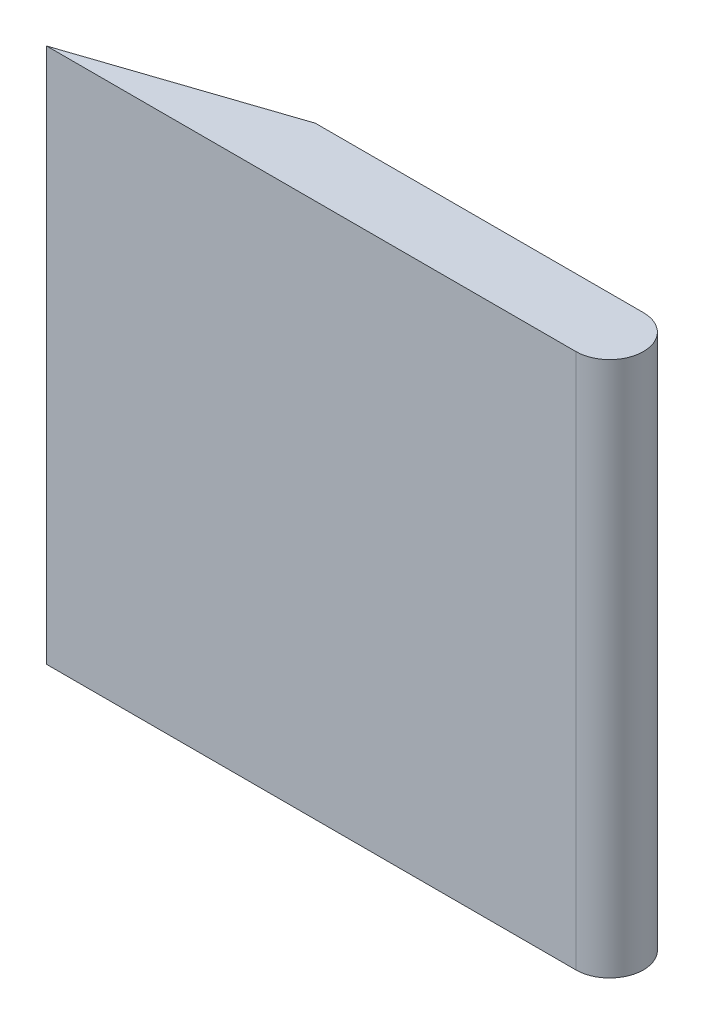
ISO-10303-21;
HEADER;
FILE_DESCRIPTION(('STEP AP214'),'2;1');
FILE_NAME('part.step','',(''),(''),'','','');
FILE_SCHEMA(('AUTOMOTIVE_DESIGN { 1 0 10303 214 1 1 1 1 }'));
ENDSEC;
DATA;
#1=APPLICATION_CONTEXT('core data for automotive mechanical design processes');
#2=APPLICATION_PROTOCOL_DEFINITION('international standard','automotive_design',2000,#1);
#3=PRODUCT_CONTEXT('',#1,'mechanical');
#4=PRODUCT('Part','Part','',(#3));
#5=PRODUCT_RELATED_PRODUCT_CATEGORY('part','',(#4));
#6=PRODUCT_DEFINITION_FORMATION('','',#4);
#7=PRODUCT_DEFINITION_CONTEXT('part definition',#1,'design');
#8=PRODUCT_DEFINITION('design','',#6,#7);
#9=PRODUCT_DEFINITION_SHAPE('','',#8);
#10=(LENGTH_UNIT() NAMED_UNIT(*) SI_UNIT(.MILLI.,.METRE.));
#11=(NAMED_UNIT(*) PLANE_ANGLE_UNIT() SI_UNIT($,.RADIAN.));
#12=(NAMED_UNIT(*) SI_UNIT($,.STERADIAN.) SOLID_ANGLE_UNIT());
#13=UNCERTAINTY_MEASURE_WITH_UNIT(LENGTH_MEASURE(1.E-05),#10,'distance_accuracy_value','');
#14=(GEOMETRIC_REPRESENTATION_CONTEXT(3) GLOBAL_UNCERTAINTY_ASSIGNED_CONTEXT((#13)) GLOBAL_UNIT_ASSIGNED_CONTEXT((#10,
#11,#12)) REPRESENTATION_CONTEXT('',''));
#15=CARTESIAN_POINT('',(0.,0.,0.));
#16=DIRECTION('',(0.,0.,1.));
#17=DIRECTION('',(1.,0.,0.));
#18=AXIS2_PLACEMENT_3D('',#15,#16,#17);
#19=CARTESIAN_POINT('',(0.,12.7,0.));
#20=DIRECTION('',(0.,-1.,0.));
#21=DIRECTION('',(0.,0.,-1.));
#22=AXIS2_PLACEMENT_3D('',#19,#20,#21);
#23=CYLINDRICAL_SURFACE('',#22,0.8);
#24=CARTESIAN_POINT('',(0.,0.,0.));
#25=DIRECTION('',(0.,1.,0.));
#26=DIRECTION('',(0.,0.,-1.));
#27=AXIS2_PLACEMENT_3D('',#24,#25,#26);
#28=CIRCLE('',#27,0.8);
#29=CARTESIAN_POINT('',(0.,0.,0.8));
#30=VERTEX_POINT('',#29);
#31=CARTESIAN_POINT('',(0.,0.,-0.8));
#32=VERTEX_POINT('',#31);
#33=EDGE_CURVE('E96',#30,#32,#28,.T.);
#34=ORIENTED_EDGE('',*,*,#33,.T.);
#35=DIRECTION('',(0.,-1.,0.));
#36=VECTOR('',#35,1.);
#37=CARTESIAN_POINT('',(0.,12.7,-0.8));
#38=LINE('',#37,#36);
#39=CARTESIAN_POINT('',(0.,12.7,-0.8));
#40=VERTEX_POINT('',#39);
#41=EDGE_CURVE('E11',#40,#32,#38,.T.);
#42=ORIENTED_EDGE('',*,*,#41,.F.);
#43=CARTESIAN_POINT('',(0.,12.7,0.));
#44=DIRECTION('',(0.,1.,0.));
#45=DIRECTION('',(0.,0.,-1.));
#46=AXIS2_PLACEMENT_3D('',#43,#44,#45);
#47=CIRCLE('',#46,0.8);
#48=CARTESIAN_POINT('',(0.,12.7,0.8));
#49=VERTEX_POINT('',#48);
#50=EDGE_CURVE('E84',#49,#40,#47,.T.);
#51=ORIENTED_EDGE('',*,*,#50,.F.);
#52=DIRECTION('',(0.,-1.,0.));
#53=VECTOR('',#52,1.);
#54=CARTESIAN_POINT('',(0.,12.7,0.8));
#55=LINE('',#54,#53);
#56=EDGE_CURVE('E92',#49,#30,#55,.T.);
#57=ORIENTED_EDGE('',*,*,#56,.T.);
#58=EDGE_LOOP('',(#34,#42,#51,#57));
#59=FACE_BOUND('',#58,.T.);
#60=ADVANCED_FACE('F33',(#59),#23,.T.);
#61=CARTESIAN_POINT('',(0.,12.7,-0.8));
#62=DIRECTION('',(0.,0.,1.));
#63=DIRECTION('',(1.,0.,0.));
#64=AXIS2_PLACEMENT_3D('',#61,#62,#63);
#65=PLANE('',#64);
#66=DIRECTION('',(-1.,0.,0.));
#67=VECTOR('',#66,1.);
#68=CARTESIAN_POINT('',(0.,0.,-0.8));
#69=LINE('',#68,#67);
#70=CARTESIAN_POINT('',(-7.78,0.,-0.799999999999999));
#71=VERTEX_POINT('',#70);
#72=EDGE_CURVE('E88',#32,#71,#69,.T.);
#73=ORIENTED_EDGE('',*,*,#72,.T.);
#74=DIRECTION('',(0.,-1.,0.));
#75=VECTOR('',#74,1.);
#76=CARTESIAN_POINT('',(-7.78,12.7,-0.799999999999999));
#77=LINE('',#76,#75);
#78=CARTESIAN_POINT('',(-7.78,12.7,-0.799999999999999));
#79=VERTEX_POINT('',#78);
#80=EDGE_CURVE('E41',#79,#71,#77,.T.);
#81=ORIENTED_EDGE('',*,*,#80,.F.);
#82=DIRECTION('',(-1.,0.,0.));
#83=VECTOR('',#82,1.);
#84=CARTESIAN_POINT('',(0.,12.7,-0.8));
#85=LINE('',#84,#83);
#86=EDGE_CURVE('E79',#40,#79,#85,.T.);
#87=ORIENTED_EDGE('',*,*,#86,.F.);
#88=ORIENTED_EDGE('',*,*,#41,.T.);
#89=EDGE_LOOP('',(#73,#81,#87,#88));
#90=FACE_BOUND('',#89,.T.);
#91=ADVANCED_FACE('F87',(#90),#65,.F.);
#92=CARTESIAN_POINT('',(-7.78,12.7,-0.799999999999999));
#93=DIRECTION('',(0.318016044090536,0.,0.948085331444911));
#94=DIRECTION('',(0.948085331444911,0.,-0.318016044090536));
#95=AXIS2_PLACEMENT_3D('',#92,#93,#94);
#96=PLANE('',#95);
#97=DIRECTION('',(-0.948085331444911,0.,0.318016044090536));
#98=VECTOR('',#97,1.);
#99=CARTESIAN_POINT('',(-7.78,0.,-0.799999999999999));
#100=LINE('',#99,#98);
#101=CARTESIAN_POINT('',(-12.55,0.,0.800000000000002));
#102=VERTEX_POINT('',#101);
#103=EDGE_CURVE('E66',#71,#102,#100,.T.);
#104=ORIENTED_EDGE('',*,*,#103,.T.);
#105=DIRECTION('',(0.,-1.,0.));
#106=VECTOR('',#105,1.);
#107=CARTESIAN_POINT('',(-12.55,12.7,0.800000000000002));
#108=LINE('',#107,#106);
#109=CARTESIAN_POINT('',(-12.55,12.7,0.800000000000002));
#110=VERTEX_POINT('',#109);
#111=EDGE_CURVE('E89',#110,#102,#108,.T.);
#112=ORIENTED_EDGE('',*,*,#111,.F.);
#113=DIRECTION('',(-0.948085331444911,0.,0.318016044090536));
#114=VECTOR('',#113,1.);
#115=CARTESIAN_POINT('',(-7.78,12.7,-0.799999999999999));
#116=LINE('',#115,#114);
#117=EDGE_CURVE('E82',#79,#110,#116,.T.);
#118=ORIENTED_EDGE('',*,*,#117,.F.);
#119=ORIENTED_EDGE('',*,*,#80,.T.);
#120=EDGE_LOOP('',(#104,#112,#118,#119));
#121=FACE_BOUND('',#120,.T.);
#122=ADVANCED_FACE('F90',(#121),#96,.F.);
#123=CARTESIAN_POINT('',(0.,12.7,0.8));
#124=DIRECTION('',(0.,0.,-1.));
#125=DIRECTION('',(-1.,0.,0.));
#126=AXIS2_PLACEMENT_3D('',#123,#124,#125);
#127=PLANE('',#126);
#128=DIRECTION('',(1.,0.,0.));
#129=VECTOR('',#128,1.);
#130=CARTESIAN_POINT('',(0.,0.,0.8));
#131=LINE('',#130,#129);
#132=EDGE_CURVE('E72',#102,#30,#131,.T.);
#133=ORIENTED_EDGE('',*,*,#132,.T.);
#134=ORIENTED_EDGE('',*,*,#56,.F.);
#135=DIRECTION('',(1.,0.,0.));
#136=VECTOR('',#135,1.);
#137=CARTESIAN_POINT('',(0.,12.7,0.8));
#138=LINE('',#137,#136);
#139=EDGE_CURVE('E49',#110,#49,#138,.T.);
#140=ORIENTED_EDGE('',*,*,#139,.F.);
#141=ORIENTED_EDGE('',*,*,#111,.T.);
#142=EDGE_LOOP('',(#133,#134,#140,#141));
#143=FACE_BOUND('',#142,.T.);
#144=ADVANCED_FACE('F103',(#143),#127,.F.);
#145=CARTESIAN_POINT('',(0.,12.7,0.));
#146=DIRECTION('',(0.,-1.,0.));
#147=DIRECTION('',(0.,0.,-1.));
#148=AXIS2_PLACEMENT_3D('',#145,#146,#147);
#149=PLANE('',#148);
#150=ORIENTED_EDGE('',*,*,#50,.T.);
#151=ORIENTED_EDGE('',*,*,#86,.T.);
#152=ORIENTED_EDGE('',*,*,#117,.T.);
#153=ORIENTED_EDGE('',*,*,#139,.T.);
#154=EDGE_LOOP('',(#150,#151,#152,#153));
#155=FACE_BOUND('',#154,.T.);
#156=ADVANCED_FACE('F80',(#155),#149,.F.);
#157=CARTESIAN_POINT('',(0.,0.,0.));
#158=DIRECTION('',(0.,-1.,0.));
#159=DIRECTION('',(0.,0.,-1.));
#160=AXIS2_PLACEMENT_3D('',#157,#158,#159);
#161=PLANE('',#160);
#162=ORIENTED_EDGE('',*,*,#33,.F.);
#163=ORIENTED_EDGE('',*,*,#132,.F.);
#164=ORIENTED_EDGE('',*,*,#103,.F.);
#165=ORIENTED_EDGE('',*,*,#72,.F.);
#166=EDGE_LOOP('',(#162,#163,#164,#165));
#167=FACE_BOUND('',#166,.T.);
#168=ADVANCED_FACE('F106',(#167),#161,.T.);
#169=CLOSED_SHELL('',(#60,#91,#122,#144,#156,#168));
#170=MANIFOLD_SOLID_BREP('B2',#169);
#171=ADVANCED_BREP_SHAPE_REPRESENTATION('',(#18,#170),#14);
#172=SHAPE_DEFINITION_REPRESENTATION(#9,#171);
ENDSEC;
END-ISO-10303-21;
